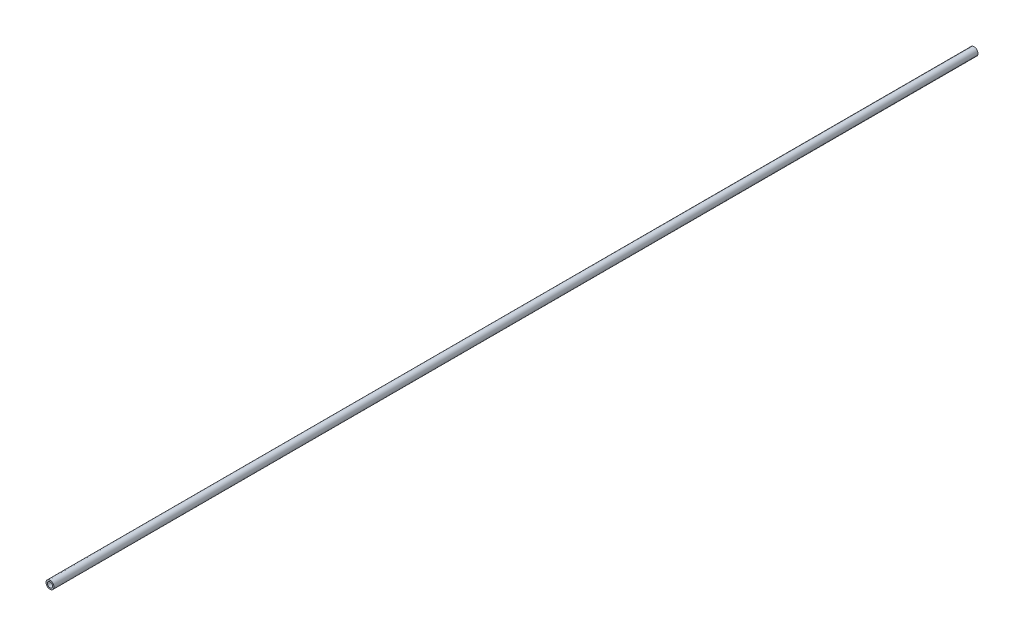
ISO-10303-21;
HEADER;
FILE_DESCRIPTION(('STEP AP214'),'2;1');
FILE_NAME('part.step','',(''),(''),'','','');
FILE_SCHEMA(('AUTOMOTIVE_DESIGN { 1 0 10303 214 1 1 1 1 }'));
ENDSEC;
DATA;
#1=APPLICATION_CONTEXT('core data for automotive mechanical design processes');
#2=APPLICATION_PROTOCOL_DEFINITION('international standard','automotive_design',2000,#1);
#3=PRODUCT_CONTEXT('',#1,'mechanical');
#4=PRODUCT('Part','Part','',(#3));
#5=PRODUCT_RELATED_PRODUCT_CATEGORY('part','',(#4));
#6=PRODUCT_DEFINITION_FORMATION('','',#4);
#7=PRODUCT_DEFINITION_CONTEXT('part definition',#1,'design');
#8=PRODUCT_DEFINITION('design','',#6,#7);
#9=PRODUCT_DEFINITION_SHAPE('','',#8);
#10=(LENGTH_UNIT() NAMED_UNIT(*) SI_UNIT(.MILLI.,.METRE.));
#11=(NAMED_UNIT(*) PLANE_ANGLE_UNIT() SI_UNIT($,.RADIAN.));
#12=(NAMED_UNIT(*) SI_UNIT($,.STERADIAN.) SOLID_ANGLE_UNIT());
#13=UNCERTAINTY_MEASURE_WITH_UNIT(LENGTH_MEASURE(1.E-05),#10,'distance_accuracy_value','');
#14=(GEOMETRIC_REPRESENTATION_CONTEXT(3) GLOBAL_UNCERTAINTY_ASSIGNED_CONTEXT((#13)) GLOBAL_UNIT_ASSIGNED_CONTEXT((#10,
#11,#12)) REPRESENTATION_CONTEXT('',''));
#15=CARTESIAN_POINT('',(0.,0.,0.));
#16=DIRECTION('',(0.,0.,1.));
#17=DIRECTION('',(1.,0.,0.));
#18=AXIS2_PLACEMENT_3D('',#15,#16,#17);
#19=CARTESIAN_POINT('',(0.,0.,350.));
#20=DIRECTION('',(0.,0.,1.));
#21=DIRECTION('',(1.,0.,0.));
#22=AXIS2_PLACEMENT_3D('',#19,#20,#21);
#23=PLANE('',#22);
#24=CARTESIAN_POINT('',(0.,0.,350.));
#25=DIRECTION('',(0.,0.,1.));
#26=DIRECTION('',(1.,0.,0.));
#27=AXIS2_PLACEMENT_3D('',#24,#25,#26);
#28=CIRCLE('',#27,1.5);
#29=CARTESIAN_POINT('',(1.5,0.,350.));
#30=VERTEX_POINT('',#29);
#31=EDGE_CURVE('E10',#30,#30,#28,.T.);
#32=ORIENTED_EDGE('',*,*,#31,.T.);
#33=EDGE_LOOP('',(#32));
#34=FACE_BOUND('',#33,.T.);
#35=CARTESIAN_POINT('',(0.,0.,350.));
#36=DIRECTION('',(0.,0.,1.));
#37=DIRECTION('',(1.,0.,0.));
#38=AXIS2_PLACEMENT_3D('',#35,#36,#37);
#39=CIRCLE('',#38,1.);
#40=CARTESIAN_POINT('',(1.,0.,350.));
#41=VERTEX_POINT('',#40);
#42=EDGE_CURVE('E54',#41,#41,#39,.T.);
#43=ORIENTED_EDGE('',*,*,#42,.F.);
#44=EDGE_LOOP('',(#43));
#45=FACE_BOUND('',#44,.T.);
#46=ADVANCED_FACE('F41',(#34,#45),#23,.T.);
#47=CARTESIAN_POINT('',(0.,0.,0.));
#48=DIRECTION('',(0.,0.,1.));
#49=DIRECTION('',(1.,0.,0.));
#50=AXIS2_PLACEMENT_3D('',#47,#48,#49);
#51=PLANE('',#50);
#52=CARTESIAN_POINT('',(0.,0.,0.));
#53=DIRECTION('',(0.,0.,1.));
#54=DIRECTION('',(1.,0.,0.));
#55=AXIS2_PLACEMENT_3D('',#52,#53,#54);
#56=CIRCLE('',#55,1.5);
#57=CARTESIAN_POINT('',(1.5,0.,0.));
#58=VERTEX_POINT('',#57);
#59=EDGE_CURVE('E45',#58,#58,#56,.T.);
#60=ORIENTED_EDGE('',*,*,#59,.F.);
#61=EDGE_LOOP('',(#60));
#62=FACE_BOUND('',#61,.T.);
#63=CARTESIAN_POINT('',(0.,0.,0.));
#64=DIRECTION('',(0.,0.,1.));
#65=DIRECTION('',(1.,0.,0.));
#66=AXIS2_PLACEMENT_3D('',#63,#64,#65);
#67=CIRCLE('',#66,1.);
#68=CARTESIAN_POINT('',(1.,0.,0.));
#69=VERTEX_POINT('',#68);
#70=EDGE_CURVE('E56',#69,#69,#67,.T.);
#71=ORIENTED_EDGE('',*,*,#70,.T.);
#72=EDGE_LOOP('',(#71));
#73=FACE_BOUND('',#72,.T.);
#74=ADVANCED_FACE('F68',(#62,#73),#51,.F.);
#75=CARTESIAN_POINT('',(0.,0.,350.));
#76=DIRECTION('',(0.,0.,-1.));
#77=DIRECTION('',(-1.,0.,0.));
#78=AXIS2_PLACEMENT_3D('',#75,#76,#77);
#79=CYLINDRICAL_SURFACE('',#78,1.5);
#80=ORIENTED_EDGE('',*,*,#31,.F.);
#81=EDGE_LOOP('',(#80));
#82=FACE_BOUND('',#81,.T.);
#83=ORIENTED_EDGE('',*,*,#59,.T.);
#84=EDGE_LOOP('',(#83));
#85=FACE_BOUND('',#84,.T.);
#86=ADVANCED_FACE('F43',(#82,#85),#79,.T.);
#87=CARTESIAN_POINT('',(0.,0.,350.));
#88=DIRECTION('',(0.,0.,-1.));
#89=DIRECTION('',(-1.,0.,0.));
#90=AXIS2_PLACEMENT_3D('',#87,#88,#89);
#91=CYLINDRICAL_SURFACE('',#90,1.);
#92=ORIENTED_EDGE('',*,*,#42,.T.);
#93=EDGE_LOOP('',(#92));
#94=FACE_BOUND('',#93,.T.);
#95=ORIENTED_EDGE('',*,*,#70,.F.);
#96=EDGE_LOOP('',(#95));
#97=FACE_BOUND('',#96,.T.);
#98=ADVANCED_FACE('F64',(#94,#97),#91,.F.);
#99=CLOSED_SHELL('',(#46,#74,#86,#98));
#100=MANIFOLD_SOLID_BREP('B2',#99);
#101=ADVANCED_BREP_SHAPE_REPRESENTATION('',(#18,#100),#14);
#102=SHAPE_DEFINITION_REPRESENTATION(#9,#101);
ENDSEC;
END-ISO-10303-21;
